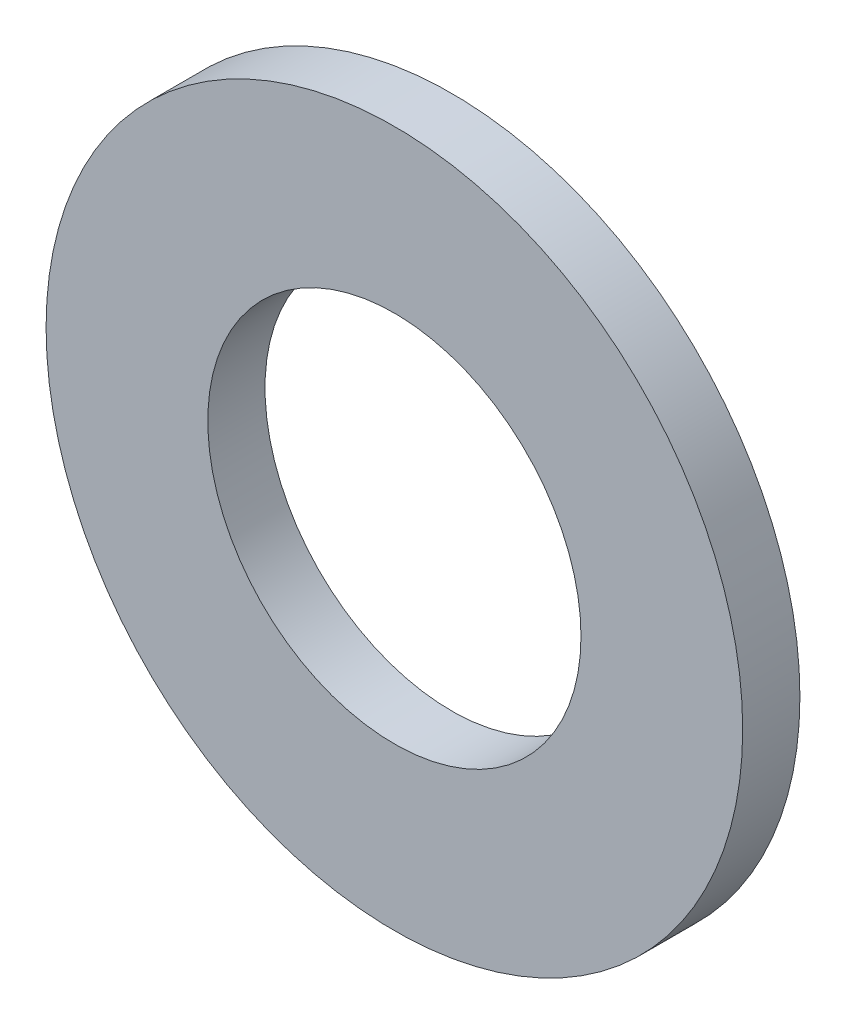
ISO-10303-21;
HEADER;
FILE_DESCRIPTION(('STEP AP214'),'2;1');
FILE_NAME('part.step','',(''),(''),'','','');
FILE_SCHEMA(('AUTOMOTIVE_DESIGN { 1 0 10303 214 1 1 1 1 }'));
ENDSEC;
DATA;
#1=APPLICATION_CONTEXT('core data for automotive mechanical design processes');
#2=APPLICATION_PROTOCOL_DEFINITION('international standard','automotive_design',2000,#1);
#3=PRODUCT_CONTEXT('',#1,'mechanical');
#4=PRODUCT('Part','Part','',(#3));
#5=PRODUCT_RELATED_PRODUCT_CATEGORY('part','',(#4));
#6=PRODUCT_DEFINITION_FORMATION('','',#4);
#7=PRODUCT_DEFINITION_CONTEXT('part definition',#1,'design');
#8=PRODUCT_DEFINITION('design','',#6,#7);
#9=PRODUCT_DEFINITION_SHAPE('','',#8);
#10=(LENGTH_UNIT() NAMED_UNIT(*) SI_UNIT(.MILLI.,.METRE.));
#11=(NAMED_UNIT(*) PLANE_ANGLE_UNIT() SI_UNIT($,.RADIAN.));
#12=(NAMED_UNIT(*) SI_UNIT($,.STERADIAN.) SOLID_ANGLE_UNIT());
#13=UNCERTAINTY_MEASURE_WITH_UNIT(LENGTH_MEASURE(1.E-05),#10,'distance_accuracy_value','');
#14=(GEOMETRIC_REPRESENTATION_CONTEXT(3) GLOBAL_UNCERTAINTY_ASSIGNED_CONTEXT((#13)) GLOBAL_UNIT_ASSIGNED_CONTEXT((#10,
#11,#12)) REPRESENTATION_CONTEXT('',''));
#15=CARTESIAN_POINT('',(0.,0.,0.));
#16=DIRECTION('',(0.,0.,1.));
#17=DIRECTION('',(1.,0.,0.));
#18=AXIS2_PLACEMENT_3D('',#15,#16,#17);
#19=CARTESIAN_POINT('',(0.,0.,-2.3));
#20=DIRECTION('',(0.,0.,1.));
#21=DIRECTION('',(1.,0.,0.));
#22=AXIS2_PLACEMENT_3D('',#19,#20,#21);
#23=CYLINDRICAL_SURFACE('',#22,14.);
#24=CARTESIAN_POINT('',(0.,0.,-2.3));
#25=DIRECTION('',(0.,0.,1.));
#26=DIRECTION('',(1.,0.,0.));
#27=AXIS2_PLACEMENT_3D('',#24,#25,#26);
#28=CIRCLE('',#27,14.);
#29=CARTESIAN_POINT('',(14.,0.,-2.3));
#30=VERTEX_POINT('',#29);
#31=EDGE_CURVE('E10',#30,#30,#28,.T.);
#32=ORIENTED_EDGE('',*,*,#31,.T.);
#33=EDGE_LOOP('',(#32));
#34=FACE_BOUND('',#33,.T.);
#35=CARTESIAN_POINT('',(0.,0.,0.));
#36=DIRECTION('',(0.,0.,1.));
#37=DIRECTION('',(1.,0.,0.));
#38=AXIS2_PLACEMENT_3D('',#35,#36,#37);
#39=CIRCLE('',#38,14.);
#40=CARTESIAN_POINT('',(14.,0.,0.));
#41=VERTEX_POINT('',#40);
#42=EDGE_CURVE('E33',#41,#41,#39,.T.);
#43=ORIENTED_EDGE('',*,*,#42,.F.);
#44=EDGE_LOOP('',(#43));
#45=FACE_BOUND('',#44,.T.);
#46=ADVANCED_FACE('F30',(#34,#45),#23,.T.);
#47=CARTESIAN_POINT('',(0.,0.,-2.3));
#48=DIRECTION('',(0.,0.,1.));
#49=DIRECTION('',(1.,0.,0.));
#50=AXIS2_PLACEMENT_3D('',#47,#48,#49);
#51=PLANE('',#50);
#52=CARTESIAN_POINT('',(0.,0.,-2.3));
#53=DIRECTION('',(0.,0.,1.));
#54=DIRECTION('',(1.,0.,0.));
#55=AXIS2_PLACEMENT_3D('',#52,#53,#54);
#56=CIRCLE('',#55,7.5);
#57=CARTESIAN_POINT('',(7.5,0.,-2.3));
#58=VERTEX_POINT('',#57);
#59=EDGE_CURVE('E40',#58,#58,#56,.T.);
#60=ORIENTED_EDGE('',*,*,#59,.T.);
#61=EDGE_LOOP('',(#60));
#62=FACE_BOUND('',#61,.T.);
#63=ORIENTED_EDGE('',*,*,#31,.F.);
#64=EDGE_LOOP('',(#63));
#65=FACE_BOUND('',#64,.T.);
#66=ADVANCED_FACE('F48',(#62,#65),#51,.F.);
#67=CARTESIAN_POINT('',(0.,0.,0.));
#68=DIRECTION('',(0.,0.,1.));
#69=DIRECTION('',(1.,0.,0.));
#70=AXIS2_PLACEMENT_3D('',#67,#68,#69);
#71=PLANE('',#70);
#72=CARTESIAN_POINT('',(0.,0.,0.));
#73=DIRECTION('',(0.,0.,1.));
#74=DIRECTION('',(1.,0.,0.));
#75=AXIS2_PLACEMENT_3D('',#72,#73,#74);
#76=CIRCLE('',#75,7.5);
#77=CARTESIAN_POINT('',(7.5,0.,0.));
#78=VERTEX_POINT('',#77);
#79=EDGE_CURVE('E42',#78,#78,#76,.T.);
#80=ORIENTED_EDGE('',*,*,#79,.F.);
#81=EDGE_LOOP('',(#80));
#82=FACE_BOUND('',#81,.T.);
#83=ORIENTED_EDGE('',*,*,#42,.T.);
#84=EDGE_LOOP('',(#83));
#85=FACE_BOUND('',#84,.T.);
#86=ADVANCED_FACE('F54',(#82,#85),#71,.T.);
#87=CARTESIAN_POINT('',(0.,0.,-2.3));
#88=DIRECTION('',(0.,0.,1.));
#89=DIRECTION('',(1.,0.,0.));
#90=AXIS2_PLACEMENT_3D('',#87,#88,#89);
#91=CYLINDRICAL_SURFACE('',#90,7.5);
#92=ORIENTED_EDGE('',*,*,#59,.F.);
#93=EDGE_LOOP('',(#92));
#94=FACE_BOUND('',#93,.T.);
#95=ORIENTED_EDGE('',*,*,#79,.T.);
#96=EDGE_LOOP('',(#95));
#97=FACE_BOUND('',#96,.T.);
#98=ADVANCED_FACE('F51',(#94,#97),#91,.F.);
#99=CLOSED_SHELL('',(#46,#66,#86,#98));
#100=MANIFOLD_SOLID_BREP('B2',#99);
#101=ADVANCED_BREP_SHAPE_REPRESENTATION('',(#18,#100),#14);
#102=SHAPE_DEFINITION_REPRESENTATION(#9,#101);
ENDSEC;
END-ISO-10303-21;
